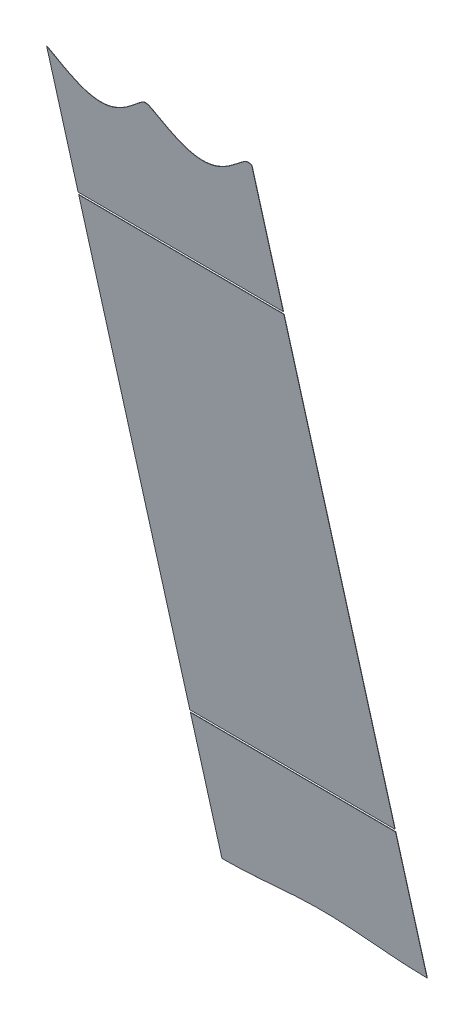
ISO-10303-21;
HEADER;
FILE_DESCRIPTION(('STEP AP214'),'2;1');
FILE_NAME('part.step','',(''),(''),'','','');
FILE_SCHEMA(('AUTOMOTIVE_DESIGN { 1 0 10303 214 1 1 1 1 }'));
ENDSEC;
DATA;
#1=APPLICATION_CONTEXT('core data for automotive mechanical design processes');
#2=APPLICATION_PROTOCOL_DEFINITION('international standard','automotive_design',2000,#1);
#3=PRODUCT_CONTEXT('',#1,'mechanical');
#4=PRODUCT('Part','Part','',(#3));
#5=PRODUCT_RELATED_PRODUCT_CATEGORY('part','',(#4));
#6=PRODUCT_DEFINITION_FORMATION('','',#4);
#7=PRODUCT_DEFINITION_CONTEXT('part definition',#1,'design');
#8=PRODUCT_DEFINITION('design','',#6,#7);
#9=PRODUCT_DEFINITION_SHAPE('','',#8);
#10=(LENGTH_UNIT() NAMED_UNIT(*) SI_UNIT(.MILLI.,.METRE.));
#11=(NAMED_UNIT(*) PLANE_ANGLE_UNIT() SI_UNIT($,.RADIAN.));
#12=(NAMED_UNIT(*) SI_UNIT($,.STERADIAN.) SOLID_ANGLE_UNIT());
#13=UNCERTAINTY_MEASURE_WITH_UNIT(LENGTH_MEASURE(1.E-05),#10,'distance_accuracy_value','');
#14=(GEOMETRIC_REPRESENTATION_CONTEXT(3) GLOBAL_UNCERTAINTY_ASSIGNED_CONTEXT((#13)) GLOBAL_UNIT_ASSIGNED_CONTEXT((#10,
#11,#12)) REPRESENTATION_CONTEXT('',''));
#15=CARTESIAN_POINT('',(0.,0.,0.));
#16=DIRECTION('',(0.,0.,1.));
#17=DIRECTION('',(1.,0.,0.));
#18=AXIS2_PLACEMENT_3D('',#15,#16,#17);
#19=CARTESIAN_POINT('',(-2042.50921980011,-2777.14365641032,-1017.93932816714));
#20=DIRECTION('',(0.00396825396827988,0.216307580433428,-0.976317204400025));
#21=DIRECTION('',(0.,0.976324891543631,0.216309283555555));
#22=AXIS2_PLACEMENT_3D('',#19,#20,#21);
#23=PLANE('',#22);
#24=DIRECTION('',(-0.999992126449225,0.000858370172845619,-0.00387430512519836));
#25=VECTOR('',#24,1.);
#26=CARTESIAN_POINT('',(1159.43166885493,323.596464984366,-317.941720044152));
#27=LINE('',#26,#25);
#28=CARTESIAN_POINT('',(1159.43166885493,323.596464984366,-317.941720044152));
#29=VERTEX_POINT('',#28);
#30=CARTESIAN_POINT('',(1080.0503968254,323.664604037055,-318.249269734728));
#31=VERTEX_POINT('',#30);
#32=EDGE_CURVE('E14',#29,#31,#27,.T.);
#33=ORIENTED_EDGE('',*,*,#32,.F.);
#34=DIRECTION('',(0.,0.976324891543631,0.216309283555555));
#35=VECTOR('',#34,1.);
#36=CARTESIAN_POINT('',(1159.43166885493,268.764554189019,-330.089982823123));
#37=LINE('',#36,#35);
#38=CARTESIAN_POINT('',(1159.43166885493,268.76455418902,-330.089982823123));
#39=VERTEX_POINT('',#38);
#40=EDGE_CURVE('E97',#39,#29,#37,.T.);
#41=ORIENTED_EDGE('',*,*,#40,.F.);
#42=CARTESIAN_POINT('',(1080.0503968254,268.832693241709,-330.397532513701));
#43=CARTESIAN_POINT('',(1081.28657677685,268.832154777076,-330.392627343542));
#44=CARTESIAN_POINT('',(1083.75887986082,268.88232858076,-330.37146239786));
#45=CARTESIAN_POINT('',(1086.23015212249,268.981709060538,-330.339399675887));
#46=CARTESIAN_POINT('',(1088.10494027586,269.091496299278,-330.307455705871));
#47=CARTESIAN_POINT('',(1089.34359677935,269.174386300955,-330.284056508164));
#48=CARTESIAN_POINT('',(1090.5819230257,269.266799692385,-330.25854870186));
#49=CARTESIAN_POINT('',(1091.81975763451,269.367820493785,-330.231135882438));
#50=CARTESIAN_POINT('',(1093.05682318214,269.476437232262,-330.202043273976));
#51=CARTESIAN_POINT('',(1094.29259657661,269.591538717598,-330.171519191906));
#52=CARTESIAN_POINT('',(1095.52595576158,269.711886947185,-330.139842482029));
#53=CARTESIAN_POINT('',(1096.75397113525,269.836000428043,-330.107353283354));
#54=CARTESIAN_POINT('',(1097.41505008186,269.904474955457,-330.089495471958));
#55=CARTESIAN_POINT('',(1097.96579856127,269.961521458065,-330.074618031793));
#56=CARTESIAN_POINT('',(1098.93006794415,270.062854892485,-330.0482478565));
#57=CARTESIAN_POINT('',(1099.27554864505,270.09928975265,-330.038771334355));
#58=CARTESIAN_POINT('',(1099.47315232273,270.120129302719,-330.033351073187));
#59=CARTESIAN_POINT('',(1100.30136490481,270.207571078724,-330.010611663534));
#60=CARTESIAN_POINT('',(1100.51588102051,270.230189805864,-330.004728476654));
#61=CARTESIAN_POINT('',(1100.85940209737,270.266410905052,-329.995307279157));
#62=CARTESIAN_POINT('',(1101.8236620147,270.367703554007,-329.968946178545));
#63=CARTESIAN_POINT('',(1102.3763795837,270.424908617498,-329.954025605095));
#64=CARTESIAN_POINT('',(1103.03667741919,270.49324800405,-329.936200909616));
#65=CARTESIAN_POINT('',(1104.26501988036,270.617244420893,-329.903736317562));
#66=CARTESIAN_POINT('',(1105.49851344342,270.737407020949,-329.872100188583));
#67=CARTESIAN_POINT('',(1106.7343548516,270.852269552151,-329.841628771461));
#68=CARTESIAN_POINT('',(1107.97145931655,270.96060030897,-329.812599365374));
#69=CARTESIAN_POINT('',(1109.20931799006,271.061292397321,-329.785259276033));
#70=CARTESIAN_POINT('',(1110.44766017679,271.153338232103,-329.75983283881));
#71=CARTESIAN_POINT('',(1111.68632768145,271.235825718451,-329.736522775517));
#72=CARTESIAN_POINT('',(1113.56097135429,271.344947989544,-329.704726719393));
#73=CARTESIAN_POINT('',(1116.03227482633,271.443367873024,-329.672876695106));
#74=CARTESIAN_POINT('',(1118.50464108415,271.492521149077,-329.651937595258));
#75=CARTESIAN_POINT('',(1120.97732547755,271.490399688146,-329.642357356854));
#76=CARTESIAN_POINT('',(1123.44969181017,271.43700399542,-329.644138453798));
#77=CARTESIAN_POINT('',(1125.92099538589,271.334343396408,-329.65683873758));
#78=CARTESIAN_POINT('',(1127.79563873341,271.22200414699,-329.674108504261));
#79=CARTESIAN_POINT('',(1129.03430617277,271.137390979305,-329.687820361977));
#80=CARTESIAN_POINT('',(1130.27264842064,271.043219945334,-329.703651130805));
#81=CARTESIAN_POINT('',(1131.51050729436,270.940403398927,-329.721399317477));
#82=CARTESIAN_POINT('',(1132.74761175264,270.82994941386,-329.740842680246));
#83=CARTESIAN_POINT('',(1133.98345321428,270.712965731145,-329.761737861118));
#84=CARTESIAN_POINT('',(1135.21694709448,270.590685890966,-329.783815971882));
#85=CARTESIAN_POINT('',(1136.44529010488,270.464580955938,-329.806762485833));
#86=CARTESIAN_POINT('',(1137.10568609662,270.395097781947,-329.819472615467));
#87=CARTESIAN_POINT('',(1137.65830764849,270.336954031955,-329.830108494017));
#88=CARTESIAN_POINT('',(1138.62256752162,270.23400607159,-329.848997842751));
#89=CARTESIAN_POINT('',(1138.96618465982,270.197184952217,-329.855759095281));
#90=CARTESIAN_POINT('',(1139.18062966248,270.174205583134,-329.859978666005));
#91=CARTESIAN_POINT('',(1140.00885358341,270.085340754786,-329.876300751771));
#92=CARTESIAN_POINT('',(1140.20651703528,270.064155553607,-329.880191025151));
#93=CARTESIAN_POINT('',(1140.55190227623,270.027137805791,-329.886988655143));
#94=CARTESIAN_POINT('',(1141.51617143731,269.924148904419,-329.905887036795));
#95=CARTESIAN_POINT('',(1142.06701559847,269.866146738319,-329.916498771008));
#96=CARTESIAN_POINT('',(1142.72799642586,269.796547525979,-329.929232232401));
#97=CARTESIAN_POINT('',(1143.95601107499,269.670325623311,-329.952205995701));
#98=CARTESIAN_POINT('',(1145.18937001639,269.547859650603,-329.974325893447));
#99=CARTESIAN_POINT('',(1146.42514337524,269.430636164723,-329.99527448062));
#100=CARTESIAN_POINT('',(1147.66220883727,269.31989512445,-330.014781600296));
#101=CARTESIAN_POINT('',(1148.90004339047,269.216748615348,-330.032602990575));
#102=CARTESIAN_POINT('',(1150.13836962374,269.122208593316,-330.048515575502));
#103=CARTESIAN_POINT('',(1151.37702611206,269.037191325289,-330.062317008024));
#104=CARTESIAN_POINT('',(1153.25181459674,268.924184215867,-330.079734152258));
#105=CARTESIAN_POINT('',(1155.72308681032,268.820559266117,-330.092648219866));
#106=CARTESIAN_POINT('',(1158.19543971364,268.766138004114,-330.094656590998));
#107=CARTESIAN_POINT('',(1159.43166885493,268.76455418902,-330.089982823124));
#108=B_SPLINE_CURVE_WITH_KNOTS('',2,(#42,#43,#44,#45,#46,#47,#48,#49,#50,#51,#52,#53,#54,#55,
#56,#57,#58,#59,#60,#61,#62,#63,#64,#65,#66,#67,#68,#69,#70,#71,#72,#73,#74,#75,#76,#77,#78,#79,
#80,#81,#82,#83,#84,#85,#86,#87,#88,#89,#90,#91,#92,#93,#94,#95,#96,#97,#98,#99,#100,#101,#102,
#103,#104,#105,#106,#107),.UNSPECIFIED.,.F.,.F.,(3,1,1,1,1,1,1,1,1,1,1,2,1,2,1,2,1,2,1,1,1,1,1,
1,1,1,1,1,1,1,1,1,1,1,1,1,1,1,1,2,1,2,1,2,1,2,1,1,1,1,1,1,1,1,1,1,3),(0.,0.03125,0.0625,0.09375,
0.109375,0.125,0.140625,0.15625,0.171875,0.1875,0.203125,0.21875,0.234375,0.2421875,0.25,
0.2578125,0.265625,0.28125,0.296875,0.3125,0.328125,0.34375,0.359375,0.375,0.390625,0.40625,
0.4375,0.46875,0.5,0.53125,0.5625,0.59375,0.609375,0.625,0.640625,0.65625,0.671875,0.6875,
0.703125,0.71875,0.734375,0.7421875,0.75,0.7578125,0.765625,0.78125,0.796875,0.8125,0.828125,
0.84375,0.859375,0.875,0.890625,0.90625,0.9375,0.96875,1.),.UNSPECIFIED.);
#109=CARTESIAN_POINT('',(1080.0503968254,268.832693241709,-330.397532513701));
#110=VERTEX_POINT('',#109);
#111=EDGE_CURVE('E114',#110,#39,#108,.T.);
#112=ORIENTED_EDGE('',*,*,#111,.F.);
#113=DIRECTION('',(0.,0.976324891543631,0.216309283555555));
#114=VECTOR('',#113,1.);
#115=CARTESIAN_POINT('',(1080.0503968254,268.832693241708,-330.3975325137));
#116=LINE('',#115,#114);
#117=EDGE_CURVE('E100',#110,#31,#116,.T.);
#118=ORIENTED_EDGE('',*,*,#117,.T.);
#119=EDGE_LOOP('',(#33,#41,#112,#118));
#120=FACE_BOUND('',#119,.T.);
#121=ADVANCED_FACE('F50',(#120),#23,.T.);
#122=CARTESIAN_POINT('',(-2042.50961662551,-2777.16528716836,-1017.8416964467));
#123=DIRECTION('',(0.00396825396827988,0.216307580433428,-0.976317204400025));
#124=DIRECTION('',(0.,0.976324891543631,0.216309283555555));
#125=AXIS2_PLACEMENT_3D('',#122,#123,#124);
#126=PLANE('',#125);
#127=DIRECTION('',(0.,0.976324891543631,0.216309283555555));
#128=VECTOR('',#127,1.);
#129=CARTESIAN_POINT('',(1159.43127202953,268.742923430976,-329.992351102683));
#130=LINE('',#129,#128);
#131=CARTESIAN_POINT('',(1159.43127202953,268.742923430977,-329.992351102683));
#132=VERTEX_POINT('',#131);
#133=CARTESIAN_POINT('',(1159.43127202953,323.574834226331,-317.844088323747));
#134=VERTEX_POINT('',#133);
#135=EDGE_CURVE('E109',#132,#134,#130,.T.);
#136=ORIENTED_EDGE('',*,*,#135,.T.);
#137=DIRECTION('',(-0.999992126449225,0.000858370172845612,-0.00387430512519833));
#138=VECTOR('',#137,1.);
#139=CARTESIAN_POINT('',(-2042.50961662551,326.323306420595,-330.249481993707));
#140=LINE('',#139,#138);
#141=CARTESIAN_POINT('',(1080.05,323.64297327902,-318.151638014323));
#142=VERTEX_POINT('',#141);
#143=EDGE_CURVE('E67',#134,#142,#140,.T.);
#144=ORIENTED_EDGE('',*,*,#143,.T.);
#145=DIRECTION('',(0.,0.976324891543631,0.216309283555555));
#146=VECTOR('',#145,1.);
#147=CARTESIAN_POINT('',(1080.05,268.811062483665,-330.29990079326));
#148=LINE('',#147,#146);
#149=CARTESIAN_POINT('',(1080.05,268.811062483666,-330.299900793261));
#150=VERTEX_POINT('',#149);
#151=EDGE_CURVE('E53',#150,#142,#148,.T.);
#152=ORIENTED_EDGE('',*,*,#151,.F.);
#153=CARTESIAN_POINT('',(1080.05,268.811062483666,-330.299900793261));
#154=CARTESIAN_POINT('',(1081.28617995146,268.810524019033,-330.294995623102));
#155=CARTESIAN_POINT('',(1083.75848303542,268.860697822717,-330.27383067742));
#156=CARTESIAN_POINT('',(1086.22975529709,268.960078302495,-330.241767955447));
#157=CARTESIAN_POINT('',(1088.10454345046,269.069865541234,-330.209823985431));
#158=CARTESIAN_POINT('',(1089.34319995395,269.152755542912,-330.186424787724));
#159=CARTESIAN_POINT('',(1090.58152620031,269.245168934341,-330.16091698142));
#160=CARTESIAN_POINT('',(1091.81936080911,269.346189735742,-330.133504161998));
#161=CARTESIAN_POINT('',(1093.05642635674,269.454806474218,-330.104411553536));
#162=CARTESIAN_POINT('',(1094.29219975121,269.569907959554,-330.073887471465));
#163=CARTESIAN_POINT('',(1095.52555893618,269.690256189142,-330.042210761589));
#164=CARTESIAN_POINT('',(1096.75357430985,269.81436967,-330.009721562914));
#165=CARTESIAN_POINT('',(1097.41465325646,269.882844197413,-329.991863751517));
#166=CARTESIAN_POINT('',(1097.96540173588,269.939890700022,-329.976986311353));
#167=CARTESIAN_POINT('',(1098.92967111876,270.041224134441,-329.95061613606));
#168=CARTESIAN_POINT('',(1099.27515181965,270.077658994607,-329.941139613915));
#169=CARTESIAN_POINT('',(1099.47275549733,270.098498544676,-329.935719352747));
#170=CARTESIAN_POINT('',(1100.30096807942,270.185940320681,-329.912979943094));
#171=CARTESIAN_POINT('',(1100.51548419511,270.20855904782,-329.907096756214));
#172=CARTESIAN_POINT('',(1100.85900527198,270.244780147008,-329.897675558717));
#173=CARTESIAN_POINT('',(1101.82326518931,270.346072795963,-329.871314458105));
#174=CARTESIAN_POINT('',(1102.37598275831,270.403277859455,-329.856393884655));
#175=CARTESIAN_POINT('',(1103.03628059379,270.471617246007,-329.838569189176));
#176=CARTESIAN_POINT('',(1104.26462305496,270.59561366285,-329.806104597122));
#177=CARTESIAN_POINT('',(1105.49811661802,270.715776262905,-329.774468468143));
#178=CARTESIAN_POINT('',(1106.7339580262,270.830638794108,-329.743997051021));
#179=CARTESIAN_POINT('',(1107.97106249115,270.938969550926,-329.714967644934));
#180=CARTESIAN_POINT('',(1109.20892116466,271.039661639278,-329.687627555593));
#181=CARTESIAN_POINT('',(1110.44726335139,271.131707474059,-329.66220111837));
#182=CARTESIAN_POINT('',(1111.68593085606,271.214194960407,-329.638891055077));
#183=CARTESIAN_POINT('',(1113.56057452889,271.323317231501,-329.607094998953));
#184=CARTESIAN_POINT('',(1116.03187800094,271.42173711498,-329.575244974666));
#185=CARTESIAN_POINT('',(1118.50424425875,271.470890391033,-329.554305874818));
#186=CARTESIAN_POINT('',(1120.97692865215,271.468768930103,-329.544725636414));
#187=CARTESIAN_POINT('',(1123.44929498477,271.415373237377,-329.546506733358));
#188=CARTESIAN_POINT('',(1125.92059856049,271.312712638365,-329.55920701714));
#189=CARTESIAN_POINT('',(1127.79524190801,271.200373388946,-329.576476783821));
#190=CARTESIAN_POINT('',(1129.03390934738,271.115760221261,-329.590188641537));
#191=CARTESIAN_POINT('',(1130.27225159524,271.021589187291,-329.606019410365));
#192=CARTESIAN_POINT('',(1131.51011046896,270.918772640883,-329.623767597037));
#193=CARTESIAN_POINT('',(1132.74721492724,270.808318655817,-329.643210959806));
#194=CARTESIAN_POINT('',(1133.98305638889,270.691334973101,-329.664106140678));
#195=CARTESIAN_POINT('',(1135.21655026909,270.569055132923,-329.686184251442));
#196=CARTESIAN_POINT('',(1136.44489327949,270.442950197895,-329.709130765393));
#197=CARTESIAN_POINT('',(1137.10528927123,270.373467023903,-329.721840895027));
#198=CARTESIAN_POINT('',(1137.65791082309,270.315323273911,-329.732476773577));
#199=CARTESIAN_POINT('',(1138.62217069622,270.212375313547,-329.751366122311));
#200=CARTESIAN_POINT('',(1138.96578783442,270.175554194174,-329.758127374841));
#201=CARTESIAN_POINT('',(1139.18023283708,270.152574825091,-329.762346945565));
#202=CARTESIAN_POINT('',(1140.00845675801,270.063709996743,-329.778669031331));
#203=CARTESIAN_POINT('',(1140.20612020988,270.042524795564,-329.782559304711));
#204=CARTESIAN_POINT('',(1140.55150545083,270.005507047748,-329.789356934703));
#205=CARTESIAN_POINT('',(1141.51577461191,269.902518146376,-329.808255316355));
#206=CARTESIAN_POINT('',(1142.06661877307,269.844515980276,-329.818867050568));
#207=CARTESIAN_POINT('',(1142.72759960047,269.774916767936,-329.831600511961));
#208=CARTESIAN_POINT('',(1143.9556142496,269.648694865268,-329.854574275261));
#209=CARTESIAN_POINT('',(1145.18897319099,269.52622889256,-329.876694173007));
#210=CARTESIAN_POINT('',(1146.42474654984,269.40900540668,-329.89764276018));
#211=CARTESIAN_POINT('',(1147.66181201187,269.298264366406,-329.917149879856));
#212=CARTESIAN_POINT('',(1148.89964656507,269.195117857305,-329.934971270135));
#213=CARTESIAN_POINT('',(1150.13797279835,269.100577835273,-329.950883855062));
#214=CARTESIAN_POINT('',(1151.37662928667,269.015560567245,-329.964685287584));
#215=CARTESIAN_POINT('',(1153.25141777134,268.902553457823,-329.982102431818));
#216=CARTESIAN_POINT('',(1155.72268998492,268.798928508073,-329.995016499426));
#217=CARTESIAN_POINT('',(1158.19504288824,268.744507246071,-329.997024870558));
#218=CARTESIAN_POINT('',(1159.43127202953,268.742923430977,-329.992351102684));
#219=B_SPLINE_CURVE_WITH_KNOTS('',2,(#153,#154,#155,#156,#157,#158,#159,#160,#161,#162,#163,
#164,#165,#166,#167,#168,#169,#170,#171,#172,#173,#174,#175,#176,#177,#178,#179,#180,#181,#182,
#183,#184,#185,#186,#187,#188,#189,#190,#191,#192,#193,#194,#195,#196,#197,#198,#199,#200,#201,
#202,#203,#204,#205,#206,#207,#208,#209,#210,#211,#212,#213,#214,#215,#216,#217,#218),
.UNSPECIFIED.,.F.,.F.,(3,1,1,1,1,1,1,1,1,1,1,2,1,2,1,2,1,2,1,1,1,1,1,1,1,1,1,1,1,1,1,1,1,1,1,1,
1,1,1,2,1,2,1,2,1,2,1,1,1,1,1,1,1,1,1,1,3),(0.,0.03125,0.0625,0.09375,0.109375,0.125,0.140625,
0.15625,0.171875,0.1875,0.203125,0.21875,0.234375,0.2421875,0.25,0.2578125,0.265625,0.28125,
0.296875,0.3125,0.328125,0.34375,0.359375,0.375,0.390625,0.40625,0.4375,0.46875,0.5,0.53125,
0.5625,0.59375,0.609375,0.625,0.640625,0.65625,0.671875,0.6875,0.703125,0.71875,0.734375,
0.7421875,0.75,0.7578125,0.765625,0.78125,0.796875,0.8125,0.828125,0.84375,0.859375,0.875,
0.890625,0.90625,0.9375,0.96875,1.),.UNSPECIFIED.);
#220=EDGE_CURVE('E102',#150,#132,#219,.T.);
#221=ORIENTED_EDGE('',*,*,#220,.T.);
#222=EDGE_LOOP('',(#136,#144,#152,#221));
#223=FACE_BOUND('',#222,.T.);
#224=ADVANCED_FACE('F135',(#223),#126,.F.);
#225=CARTESIAN_POINT('',(1159.43166885493,268.764554189019,-330.089982823123));
#226=DIRECTION('',(0.999992126449225,-0.000858370172842011,0.00387430512518117));
#227=DIRECTION('',(0.00387430655247471,0.,-0.999992494846205));
#228=AXIS2_PLACEMENT_3D('',#225,#226,#227);
#229=PLANE('',#228);
#230=DIRECTION('',(0.00396825396827988,0.216307580433428,-0.976317204400025));
#231=VECTOR('',#230,1.);
#232=CARTESIAN_POINT('',(1159.39198631525,321.433389180032,-308.178548000151));
#233=LINE('',#232,#231);
#234=EDGE_CURVE('E59',#134,#29,#233,.T.);
#235=ORIENTED_EDGE('',*,*,#234,.F.);
#236=ORIENTED_EDGE('',*,*,#135,.F.);
#237=DIRECTION('',(-0.00396825396826235,-0.216307580433426,0.976317204400025));
#238=VECTOR('',#237,1.);
#239=CARTESIAN_POINT('',(1159.43166885493,268.76455418902,-330.089982823123));
#240=LINE('',#239,#238);
#241=EDGE_CURVE('E91',#39,#132,#240,.T.);
#242=ORIENTED_EDGE('',*,*,#241,.F.);
#243=ORIENTED_EDGE('',*,*,#40,.T.);
#244=EDGE_LOOP('',(#235,#236,#242,#243));
#245=FACE_BOUND('',#244,.T.);
#246=ADVANCED_FACE('F101',(#245),#229,.T.);
#247=CARTESIAN_POINT('',(1080.0503968254,268.832693241708,-330.3975325137));
#248=DIRECTION('',(0.999992126449225,-0.000858370172841317,0.00387430512518132));
#249=DIRECTION('',(0.00387430655247487,0.,-0.999992494846205));
#250=AXIS2_PLACEMENT_3D('',#247,#248,#249);
#251=PLANE('',#250);
#252=ORIENTED_EDGE('',*,*,#151,.T.);
#253=DIRECTION('',(0.00396825396826235,0.216307580433428,-0.976317204400025));
#254=VECTOR('',#253,1.);
#255=CARTESIAN_POINT('',(1080.0503968254,323.664604037055,-318.249269734728));
#256=LINE('',#255,#254);
#257=EDGE_CURVE('E105',#142,#31,#256,.T.);
#258=ORIENTED_EDGE('',*,*,#257,.T.);
#259=ORIENTED_EDGE('',*,*,#117,.F.);
#260=DIRECTION('',(-0.00396825396826235,-0.216307580433426,0.976317204400025));
#261=VECTOR('',#260,1.);
#262=CARTESIAN_POINT('',(1080.0503968254,268.832693241709,-330.397532513701));
#263=LINE('',#262,#261);
#264=EDGE_CURVE('E118',#110,#150,#263,.T.);
#265=ORIENTED_EDGE('',*,*,#264,.T.);
#266=EDGE_LOOP('',(#252,#258,#259,#265));
#267=FACE_BOUND('',#266,.T.);
#268=ADVANCED_FACE('F129',(#267),#251,.F.);
#269=DIRECTION('',(-0.00396825396826235,-0.216307580433426,0.976317204400025));
#270=VECTOR('',#269,1.);
#271=SURFACE_OF_LINEAR_EXTRUSION('',#108,#270);
#272=ORIENTED_EDGE('',*,*,#220,.F.);
#273=ORIENTED_EDGE('',*,*,#264,.F.);
#274=ORIENTED_EDGE('',*,*,#111,.T.);
#275=ORIENTED_EDGE('',*,*,#241,.T.);
#276=EDGE_LOOP('',(#272,#273,#274,#275));
#277=FACE_BOUND('',#276,.T.);
#278=ADVANCED_FACE('F126',(#277),#271,.T.);
#279=CARTESIAN_POINT('',(1159.39198631525,321.433389180032,-308.178548000151));
#280=DIRECTION('',(0.,-0.976324891543631,-0.216309283555555));
#281=DIRECTION('',(0.,0.216309283555555,-0.976324891543631));
#282=AXIS2_PLACEMENT_3D('',#279,#280,#281);
#283=PLANE('',#282);
#284=ORIENTED_EDGE('',*,*,#234,.T.);
#285=ORIENTED_EDGE('',*,*,#32,.T.);
#286=ORIENTED_EDGE('',*,*,#257,.F.);
#287=ORIENTED_EDGE('',*,*,#143,.F.);
#288=EDGE_LOOP('',(#284,#285,#286,#287));
#289=FACE_BOUND('',#288,.T.);
#290=ADVANCED_FACE('F86',(#289),#283,.F.);
#291=CLOSED_SHELL('',(#121,#224,#246,#268,#278,#290));
#292=MANIFOLD_SOLID_BREP('B2',#291);
#293=CARTESIAN_POINT('',(1080.0503968254,268.832693241708,-330.3975325137));
#294=DIRECTION('',(0.999992126449225,-0.000858370172841317,0.00387430512518132));
#295=DIRECTION('',(0.00387430655247487,0.,-0.999992494846205));
#296=AXIS2_PLACEMENT_3D('',#293,#294,#295);
#297=PLANE('',#296);
#298=DIRECTION('',(0.,0.976324891543631,0.216309283555555));
#299=VECTOR('',#298,1.);
#300=CARTESIAN_POINT('',(1080.0503968254,268.832693241708,-330.3975325137));
#301=LINE('',#300,#299);
#302=CARTESIAN_POINT('',(1080.0503968254,518.929582345781,-274.987413023618));
#303=VERTEX_POINT('',#302);
#304=CARTESIAN_POINT('',(1080.0503968254,573.69836152107,-262.853137346298));
#305=VERTEX_POINT('',#304);
#306=EDGE_CURVE('E250',#303,#305,#301,.T.);
#307=ORIENTED_EDGE('',*,*,#306,.F.);
#308=DIRECTION('',(0.00396825396827988,0.216307580433428,-0.976317204400025));
#309=VECTOR('',#308,1.);
#310=CARTESIAN_POINT('',(1080.01071428571,516.766506541447,-265.224240979617));
#311=LINE('',#310,#309);
#312=CARTESIAN_POINT('',(1080.05,518.907951587738,-274.889781303177));
#313=VERTEX_POINT('',#312);
#314=EDGE_CURVE('E203',#313,#303,#311,.T.);
#315=ORIENTED_EDGE('',*,*,#314,.F.);
#316=DIRECTION('',(0.,0.976324891543631,0.216309283555555));
#317=VECTOR('',#316,1.);
#318=CARTESIAN_POINT('',(1080.05,268.811062483665,-330.29990079326));
#319=LINE('',#318,#317);
#320=CARTESIAN_POINT('',(1080.05,573.676730763027,-262.755505625858));
#321=VERTEX_POINT('',#320);
#322=EDGE_CURVE('E197',#313,#321,#319,.T.);
#323=ORIENTED_EDGE('',*,*,#322,.T.);
#324=DIRECTION('',(-0.00396825396826235,-0.216307580433426,0.976317204400025));
#325=VECTOR('',#324,1.);
#326=CARTESIAN_POINT('',(1080.0503968254,573.69836152107,-262.853137346298));
#327=LINE('',#326,#325);
#328=EDGE_CURVE('E261',#305,#321,#327,.T.);
#329=ORIENTED_EDGE('',*,*,#328,.F.);
#330=EDGE_LOOP('',(#307,#315,#323,#329));
#331=FACE_BOUND('',#330,.T.);
#332=ADVANCED_FACE('F194',(#331),#297,.F.);
#333=CARTESIAN_POINT('',(1159.43166885493,268.764554189019,-330.089982823123));
#334=DIRECTION('',(0.999992126449225,-0.000858370172842011,0.00387430512518117));
#335=DIRECTION('',(0.00387430655247471,0.,-0.999992494846205));
#336=AXIS2_PLACEMENT_3D('',#333,#334,#335);
#337=PLANE('',#336);
#338=DIRECTION('',(0.00396825396827988,0.216307580433428,-0.976317204400025));
#339=VECTOR('',#338,1.);
#340=CARTESIAN_POINT('',(1159.39198631525,516.698367488758,-264.916691289041));
#341=LINE('',#340,#339);
#342=CARTESIAN_POINT('',(1159.43127202953,518.839812535049,-274.5822316126));
#343=VERTEX_POINT('',#342);
#344=CARTESIAN_POINT('',(1159.43166885493,518.861443293092,-274.679863333041));
#345=VERTEX_POINT('',#344);
#346=EDGE_CURVE('E243',#343,#345,#341,.T.);
#347=ORIENTED_EDGE('',*,*,#346,.T.);
#348=DIRECTION('',(0.,0.976324891543631,0.216309283555555));
#349=VECTOR('',#348,1.);
#350=CARTESIAN_POINT('',(1159.43166885493,268.764554189019,-330.089982823123));
#351=LINE('',#350,#349);
#352=CARTESIAN_POINT('',(1159.43166885493,573.693354088438,-262.531600554068));
#353=VERTEX_POINT('',#352);
#354=EDGE_CURVE('E237',#345,#353,#351,.T.);
#355=ORIENTED_EDGE('',*,*,#354,.T.);
#356=DIRECTION('',(-0.00396825396826235,-0.216307580433426,0.976317204400025));
#357=VECTOR('',#356,1.);
#358=CARTESIAN_POINT('',(1159.43166885493,573.693354088438,-262.531600554068));
#359=LINE('',#358,#357);
#360=CARTESIAN_POINT('',(1159.43127202953,573.671723330395,-262.433968833628));
#361=VERTEX_POINT('',#360);
#362=EDGE_CURVE('E241',#353,#361,#359,.T.);
#363=ORIENTED_EDGE('',*,*,#362,.T.);
#364=DIRECTION('',(0.,0.976324891543631,0.216309283555555));
#365=VECTOR('',#364,1.);
#366=CARTESIAN_POINT('',(1159.43127202953,268.742923430976,-329.992351102683));
#367=LINE('',#366,#365);
#368=EDGE_CURVE('E227',#343,#361,#367,.T.);
#369=ORIENTED_EDGE('',*,*,#368,.F.);
#370=EDGE_LOOP('',(#347,#355,#363,#369));
#371=FACE_BOUND('',#370,.T.);
#372=ADVANCED_FACE('F239',(#371),#337,.T.);
#373=CARTESIAN_POINT('',(-2042.50921980011,-2777.14365641032,-1017.93932816714));
#374=DIRECTION('',(0.00396825396827988,0.216307580433428,-0.976317204400025));
#375=DIRECTION('',(0.,0.976324891543631,0.216309283555555));
#376=AXIS2_PLACEMENT_3D('',#373,#374,#375);
#377=PLANE('',#376);
#378=DIRECTION('',(0.999992126449225,-0.000858370172845619,0.00387430512519906));
#379=VECTOR('',#378,1.);
#380=CARTESIAN_POINT('',(1159.43166885493,518.861443293092,-274.679863333041));
#381=LINE('',#380,#379);
#382=EDGE_CURVE('E48',#303,#345,#381,.T.);
#383=ORIENTED_EDGE('',*,*,#382,.F.);
#384=ORIENTED_EDGE('',*,*,#306,.T.);
#385=CARTESIAN_POINT('',(1080.0503968254,573.69836152107,-262.853137346299));
#386=CARTESIAN_POINT('',(1080.31788439468,573.526529227821,-262.890120376836));
#387=CARTESIAN_POINT('',(1080.89841880987,573.089672839256,-262.984548335286));
#388=CARTESIAN_POINT('',(1081.20861964545,572.838191218939,-263.039004433035));
#389=CARTESIAN_POINT('',(1081.63466085939,572.492797130604,-263.113796436574));
#390=CARTESIAN_POINT('',(1082.30415892398,571.918970708603,-263.238209143871));
#391=CARTESIAN_POINT('',(1082.50791152955,571.744334462725,-263.276072454636));
#392=CARTESIAN_POINT('',(1082.84543916793,571.453208471276,-263.339200875547));
#393=CARTESIAN_POINT('',(1083.30010014881,571.061052055682,-263.424236962991));
#394=CARTESIAN_POINT('',(1083.3865788515,570.98658479811,-263.440384033616));
#395=CARTESIAN_POINT('',(1084.01692328186,570.443791953263,-263.558080249191));
#396=CARTESIAN_POINT('',(1084.47679131646,570.055660052889,-263.642203522586));
#397=CARTESIAN_POINT('',(1085.06525309835,569.558994112837,-263.749850342186));
#398=CARTESIAN_POINT('',(1086.16685875163,568.66339332208,-263.943797338331));
#399=CARTESIAN_POINT('',(1086.70735084761,568.246451537767,-264.033975876868));
#400=CARTESIAN_POINT('',(1087.92003276377,567.310974838509,-264.236306093577));
#401=CARTESIAN_POINT('',(1089.02873711263,566.578595024407,-264.394061876657));
#402=CARTESIAN_POINT('',(1090.31018999781,565.732102244974,-264.576397774943));
#403=CARTESIAN_POINT('',(1091.52017718698,565.111326348714,-264.70901552977));
#404=CARTESIAN_POINT('',(1092.87975959652,564.413801617559,-264.858029311296));
#405=CARTESIAN_POINT('',(1094.18995461416,563.97986765943,-264.948844076798));
#406=CARTESIAN_POINT('',(1095.62004838482,563.506223475132,-265.047969496052));
#407=CARTESIAN_POINT('',(1098.47390204364,563.159898783333,-265.11309980384));
#408=CARTESIAN_POINT('',(1101.335114304,563.44659986613,-265.037950421955));
#409=CARTESIAN_POINT('',(1102.7710244245,563.895846000591,-264.932581593121));
#410=CARTESIAN_POINT('',(1104.0881967644,564.307943229848,-264.835925886858));
#411=CARTESIAN_POINT('',(1105.45170411015,564.987377405786,-264.679852117585));
#412=CARTESIAN_POINT('',(1106.66923269785,565.594070530868,-264.540487796247));
#413=CARTESIAN_POINT('',(1107.95561454236,566.430164423179,-264.350018821736));
#414=CARTESIAN_POINT('',(1109.07287644609,567.156337493649,-264.184590702571));
#415=CARTESIAN_POINT('',(1110.29163149233,568.088560498384,-263.973098749754));
#416=CARTESIAN_POINT('',(1110.8377694839,568.506300224725,-263.878326801363));
#417=CARTESIAN_POINT('',(1111.9440279512,569.400668631236,-263.675678953216));
#418=CARTESIAN_POINT('',(1112.5290891753,569.892605616175,-263.564310055923));
#419=CARTESIAN_POINT('',(1112.99273545153,570.28245327965,-263.476053011377));
#420=CARTESIAN_POINT('',(1113.61409444164,570.816337538286,-263.35524296935));
#421=CARTESIAN_POINT('',(1113.75698058643,570.939108214655,-263.327461797061));
#422=CARTESIAN_POINT('',(1114.49899781496,571.57819348856,-263.182853567825));
#423=CARTESIAN_POINT('',(1114.69339166376,571.744685582192,-263.145176360119));
#424=CARTESIAN_POINT('',(1115.36597755549,572.320733815984,-263.014816482485));
#425=CARTESIAN_POINT('',(1115.78800086419,572.662992351324,-262.937272205901));
#426=CARTESIAN_POINT('',(1116.09898821874,572.91520135088,-262.880130126452));
#427=CARTESIAN_POINT('',(1116.67969149545,573.352323698425,-262.78092337787));
#428=CARTESIAN_POINT('',(1117.29557156047,573.7476178393,-262.690840884918));
#429=CARTESIAN_POINT('',(1117.76287921363,573.947447141604,-262.644668403139));
#430=CARTESIAN_POINT('',(1118.11241709463,574.038646676946,-262.623042024116));
#431=CARTESIAN_POINT('',(1118.46956857436,574.05849396198,-262.617193119728));
#432=CARTESIAN_POINT('',(1118.82385194065,574.003202222236,-262.628003270384));
#433=CARTESIAN_POINT('',(1119.30437922003,573.838981897031,-262.662433931616));
#434=CARTESIAN_POINT('',(1119.93270320835,573.470606266688,-262.741495420836));
#435=CARTESIAN_POINT('',(1120.52255560918,573.050190184284,-262.832243080541));
#436=CARTESIAN_POINT('',(1121.01209217389,572.668892685965,-262.914731572507));
#437=CARTESIAN_POINT('',(1121.52208493209,572.258496534401,-263.003583860868));
#438=CARTESIAN_POINT('',(1122.21068015388,571.685963796097,-263.127632325931));
#439=CARTESIAN_POINT('',(1122.77652196183,571.211228572843,-263.230512233236));
#440=CARTESIAN_POINT('',(1123.6892749593,570.44721514056,-263.396073037166));
#441=CARTESIAN_POINT('',(1124.14653032662,570.072104062357,-263.477322106563));
#442=CARTESIAN_POINT('',(1124.73354025433,569.590548365827,-263.581627083088));
#443=CARTESIAN_POINT('',(1125.8359853196,568.719916881501,-263.770038602407));
#444=CARTESIAN_POINT('',(1126.37895293559,568.313655353851,-263.857840819029));
#445=CARTESIAN_POINT('',(1127.6114044719,567.391505249219,-264.057138113344));
#446=CARTESIAN_POINT('',(1128.73817452589,566.674629500917,-264.211385470831));
#447=CARTESIAN_POINT('',(1130.02294732066,565.857228953755,-264.387262357038));
#448=CARTESIAN_POINT('',(1131.23811233358,565.262441152483,-264.514101284205));
#449=CARTESIAN_POINT('',(1132.60038646737,564.595647730889,-264.656295461784));
#450=CARTESIAN_POINT('',(1133.91564609479,564.18839322224,-264.741178687008));
#451=CARTESIAN_POINT('',(1135.34288445289,563.746465830765,-264.833288710363));
#452=CARTESIAN_POINT('',(1138.19248405488,563.449676372378,-264.887461549349));
#453=CARTESIAN_POINT('',(1141.04300656443,563.766682788418,-264.805641329715));
#454=CARTESIAN_POINT('',(1142.47222022203,564.218163871669,-264.699804555527));
#455=CARTESIAN_POINT('',(1143.78699742516,564.633495080367,-264.602442081265));
#456=CARTESIAN_POINT('',(1145.15075718716,565.307444831147,-264.447582385737));
#457=CARTESIAN_POINT('',(1146.36093449581,565.905496422265,-264.310162515482));
#458=CARTESIAN_POINT('',(1147.64189345605,566.723440342836,-264.123736792319));
#459=CARTESIAN_POINT('',(1148.76686318018,567.441778849567,-263.960013128356));
#460=CARTESIAN_POINT('',(1149.99861383009,568.363898940389,-263.750706701921));
#461=CARTESIAN_POINT('',(1150.5417395519,568.770496769226,-263.658415535731));
#462=CARTESIAN_POINT('',(1151.64570701697,569.641967012184,-263.460850193157));
#463=CARTESIAN_POINT('',(1152.23374706215,570.123886963902,-263.351688508326));
#464=CARTESIAN_POINT('',(1152.69465208085,570.501615192078,-263.266127722455));
#465=CARTESIAN_POINT('',(1153.33318229518,571.035500899649,-263.145247566746));
#466=CARTESIAN_POINT('',(1153.363832372,571.061127937472,-263.139445200662));
#467=CARTESIAN_POINT('',(1153.88378742902,571.496451062899,-263.040883989969));
#468=CARTESIAN_POINT('',(1154.22382690313,571.781143065868,-262.97642706855));
#469=CARTESIAN_POINT('',(1154.43506501196,571.956741884688,-262.936663760156));
#470=CARTESIAN_POINT('',(1155.11630517583,572.523045800045,-262.808427605819));
#471=CARTESIAN_POINT('',(1155.55075366481,572.862857405074,-262.731374955627));
#472=CARTESIAN_POINT('',(1155.86606878776,573.109486731065,-262.675451488325));
#473=CARTESIAN_POINT('',(1156.4532801402,573.532626295859,-262.579316237606));
#474=CARTESIAN_POINT('',(1157.07374961203,573.907733960303,-262.493687497925));
#475=CARTESIAN_POINT('',(1157.54578988862,574.088155361366,-262.451795690387));
#476=CARTESIAN_POINT('',(1157.89635154521,574.161839430415,-262.434045782571));
#477=CARTESIAN_POINT('',(1158.25332371811,574.163650661354,-262.432193577964));
#478=CARTESIAN_POINT('',(1158.60496029785,574.09174692206,-262.446694951651));
#479=CARTESIAN_POINT('',(1159.07879166958,573.910924054362,-262.484831198364));
#480=CARTESIAN_POINT('',(1159.43166885493,573.693354088438,-262.531600554069));
#481=B_SPLINE_CURVE_WITH_KNOTS('',2,(#385,#386,#387,#388,#389,#390,#391,#392,#393,#394,#395,
#396,#397,#398,#399,#400,#401,#402,#403,#404,#405,#406,#407,#408,#409,#410,#411,#412,#413,#414,
#415,#416,#417,#418,#419,#420,#421,#422,#423,#424,#425,#426,#427,#428,#429,#430,#431,#432,#433,
#434,#435,#436,#437,#438,#439,#440,#441,#442,#443,#444,#445,#446,#447,#448,#449,#450,#451,#452,
#453,#454,#455,#456,#457,#458,#459,#460,#461,#462,#463,#464,#465,#466,#467,#468,#469,#470,#471,
#472,#473,#474,#475,#476,#477,#478,#479,#480),.UNSPECIFIED.,.F.,.F.,(3,1,2,2,2,2,2,1,2,2,2,2,1,
1,2,2,2,2,1,2,2,1,2,2,1,1,1,1,1,1,1,1,1,1,1,1,1,1,2,1,2,2,2,2,1,1,2,2,2,2,1,2,2,2,2,2,1,1,1,1,1,
1,1,3),(0.,0.0078125,0.015625,0.03125,0.0390625,0.046875,0.0625,0.078125,0.09375,0.125,0.15625,
0.1875,0.21875,0.25,0.28125,0.3125,0.34375,0.375,0.390625,0.40625,0.421875,0.4296875,0.4375,
0.453125,0.4609375,0.46875,0.4765625,0.48046875,0.484375,0.48828125,0.4921875,0.5,0.5078125,
0.515625,0.520833333333333,0.53125,0.5390625,0.546875,0.5625,0.578125,0.59375,0.625,0.65625,
0.6875,0.71875,0.75,0.78125,0.8125,0.84375,0.875,0.890625,0.90625,0.921875,0.9296875,0.9375,
0.953125,0.9609375,0.96875,0.9765625,0.98046875,0.984375,0.98828125,0.9921875,1.),.UNSPECIFIED.);
#482=EDGE_CURVE('E247',#305,#353,#481,.T.);
#483=ORIENTED_EDGE('',*,*,#482,.T.);
#484=ORIENTED_EDGE('',*,*,#354,.F.);
#485=EDGE_LOOP('',(#383,#384,#483,#484));
#486=FACE_BOUND('',#485,.T.);
#487=ADVANCED_FACE('F248',(#486),#377,.T.);
#488=CARTESIAN_POINT('',(-2042.50961662551,-2777.16528716836,-1017.8416964467));
#489=DIRECTION('',(0.00396825396827988,0.216307580433428,-0.976317204400025));
#490=DIRECTION('',(0.,0.976324891543631,0.216309283555555));
#491=AXIS2_PLACEMENT_3D('',#488,#489,#490);
#492=PLANE('',#491);
#493=ORIENTED_EDGE('',*,*,#322,.F.);
#494=DIRECTION('',(0.999992126449225,-0.000858370172845464,0.00387430512519836));
#495=VECTOR('',#494,1.);
#496=CARTESIAN_POINT('',(-2042.50961662551,521.588284729321,-286.987625282596));
#497=LINE('',#496,#495);
#498=EDGE_CURVE('E212',#313,#343,#497,.T.);
#499=ORIENTED_EDGE('',*,*,#498,.T.);
#500=ORIENTED_EDGE('',*,*,#368,.T.);
#501=CARTESIAN_POINT('',(1080.05,573.676730763027,-262.755505625858));
#502=CARTESIAN_POINT('',(1080.31748756928,573.504898469777,-262.792488656396));
#503=CARTESIAN_POINT('',(1080.89802198447,573.068042081212,-262.886916614846));
#504=CARTESIAN_POINT('',(1081.20822282005,572.816560460895,-262.941372712595));
#505=CARTESIAN_POINT('',(1081.63426403399,572.47116637256,-263.016164716134));
#506=CARTESIAN_POINT('',(1082.30376209859,571.89733995056,-263.140577423431));
#507=CARTESIAN_POINT('',(1082.50751470415,571.722703704682,-263.178440734196));
#508=CARTESIAN_POINT('',(1082.84504234253,571.431577713233,-263.241569155107));
#509=CARTESIAN_POINT('',(1083.29970332341,571.039421297639,-263.326605242551));
#510=CARTESIAN_POINT('',(1083.3861820261,570.964954040067,-263.342752313176));
#511=CARTESIAN_POINT('',(1084.01652645646,570.422161195219,-263.460448528751));
#512=CARTESIAN_POINT('',(1084.47639449106,570.034029294845,-263.544571802146));
#513=CARTESIAN_POINT('',(1085.06485627295,569.537363354794,-263.652218621746));
#514=CARTESIAN_POINT('',(1086.16646192624,568.641762564037,-263.846165617891));
#515=CARTESIAN_POINT('',(1086.70695402222,568.224820779724,-263.936344156428));
#516=CARTESIAN_POINT('',(1087.91963593837,567.289344080466,-264.138674373137));
#517=CARTESIAN_POINT('',(1089.02834028723,566.556964266364,-264.296430156217));
#518=CARTESIAN_POINT('',(1090.30979317242,565.710471486931,-264.478766054503));
#519=CARTESIAN_POINT('',(1091.51978036158,565.089695590671,-264.61138380933));
#520=CARTESIAN_POINT('',(1092.87936277113,564.392170859515,-264.760397590856));
#521=CARTESIAN_POINT('',(1094.18955778876,563.958236901387,-264.851212356358));
#522=CARTESIAN_POINT('',(1095.61965155942,563.484592717089,-264.950337775612));
#523=CARTESIAN_POINT('',(1098.47350521824,563.138268025289,-265.0154680834));
#524=CARTESIAN_POINT('',(1101.3347174786,563.424969108087,-264.940318701515));
#525=CARTESIAN_POINT('',(1102.7706275991,563.874215242548,-264.834949872681));
#526=CARTESIAN_POINT('',(1104.087799939,564.286312471805,-264.738294166418));
#527=CARTESIAN_POINT('',(1105.45130728475,564.965746647743,-264.582220397145));
#528=CARTESIAN_POINT('',(1106.66883587245,565.572439772825,-264.442856075807));
#529=CARTESIAN_POINT('',(1107.95521771696,566.408533665136,-264.252387101296));
#530=CARTESIAN_POINT('',(1109.07247962069,567.134706735605,-264.086958982131));
#531=CARTESIAN_POINT('',(1110.29123466694,568.066929740341,-263.875467029314));
#532=CARTESIAN_POINT('',(1110.8373726585,568.484669466682,-263.780695080923));
#533=CARTESIAN_POINT('',(1111.9436311258,569.379037873193,-263.578047232776));
#534=CARTESIAN_POINT('',(1112.5286923499,569.870974858132,-263.466678335483));
#535=CARTESIAN_POINT('',(1112.99233862613,570.260822521607,-263.378421290937));
#536=CARTESIAN_POINT('',(1113.61369761624,570.794706780242,-263.25761124891));
#537=CARTESIAN_POINT('',(1113.75658376104,570.917477456611,-263.229830076621));
#538=CARTESIAN_POINT('',(1114.49860098956,571.556562730517,-263.085221847385));
#539=CARTESIAN_POINT('',(1114.69299483836,571.723054824149,-263.047544639679));
#540=CARTESIAN_POINT('',(1115.36558073009,572.29910305794,-262.917184762045));
#541=CARTESIAN_POINT('',(1115.7876040388,572.641361593281,-262.839640485461));
#542=CARTESIAN_POINT('',(1116.09859139334,572.893570592837,-262.782498406012));
#543=CARTESIAN_POINT('',(1116.67929467006,573.330692940382,-262.68329165743));
#544=CARTESIAN_POINT('',(1117.29517473507,573.725987081257,-262.593209164478));
#545=CARTESIAN_POINT('',(1117.76248238824,573.925816383561,-262.547036682699));
#546=CARTESIAN_POINT('',(1118.11202026923,574.017015918903,-262.525410303676));
#547=CARTESIAN_POINT('',(1118.46917174896,574.036863203936,-262.519561399288));
#548=CARTESIAN_POINT('',(1118.82345511526,573.981571464193,-262.530371549944));
#549=CARTESIAN_POINT('',(1119.30398239463,573.817351138988,-262.564802211176));
#550=CARTESIAN_POINT('',(1119.93230638295,573.448975508644,-262.643863700396));
#551=CARTESIAN_POINT('',(1120.52215878378,573.028559426241,-262.734611360101));
#552=CARTESIAN_POINT('',(1121.01169534849,572.647261927922,-262.817099852067));
#553=CARTESIAN_POINT('',(1121.5216881067,572.236865776358,-262.905952140428));
#554=CARTESIAN_POINT('',(1122.21028332848,571.664333038054,-263.030000605491));
#555=CARTESIAN_POINT('',(1122.77612513644,571.189597814799,-263.132880512796));
#556=CARTESIAN_POINT('',(1123.68887813391,570.425584382517,-263.298441316726));
#557=CARTESIAN_POINT('',(1124.14613350122,570.050473304313,-263.379690386123));
#558=CARTESIAN_POINT('',(1124.73314342893,569.568917607784,-263.483995362648));
#559=CARTESIAN_POINT('',(1125.83558849421,568.698286123457,-263.672406881967));
#560=CARTESIAN_POINT('',(1126.37855611019,568.292024595808,-263.760209098589));
#561=CARTESIAN_POINT('',(1127.6110076465,567.369874491176,-263.959506392904));
#562=CARTESIAN_POINT('',(1128.73777770049,566.652998742874,-264.113753750391));
#563=CARTESIAN_POINT('',(1130.02255049527,565.835598195712,-264.289630636598));
#564=CARTESIAN_POINT('',(1131.23771550819,565.240810394439,-264.416469563765));
#565=CARTESIAN_POINT('',(1132.59998964198,564.574016972846,-264.558663741344));
#566=CARTESIAN_POINT('',(1133.91524926939,564.166762464197,-264.643546966568));
#567=CARTESIAN_POINT('',(1135.3424876275,563.724835072721,-264.735656989923));
#568=CARTESIAN_POINT('',(1138.19208722948,563.428045614335,-264.789829828908));
#569=CARTESIAN_POINT('',(1141.04260973903,563.745052030375,-264.708009609275));
#570=CARTESIAN_POINT('',(1142.47182339664,564.196533113626,-264.602172835087));
#571=CARTESIAN_POINT('',(1143.78660059976,564.611864322324,-264.504810360825));
#572=CARTESIAN_POINT('',(1145.15036036176,565.285814073104,-264.349950665297));
#573=CARTESIAN_POINT('',(1146.36053767042,565.883865664221,-264.212530795042));
#574=CARTESIAN_POINT('',(1147.64149663065,566.701809584792,-264.026105071879));
#575=CARTESIAN_POINT('',(1148.76646635478,567.420148091523,-263.862381407916));
#576=CARTESIAN_POINT('',(1149.99821700469,568.342268182346,-263.653074981481));
#577=CARTESIAN_POINT('',(1150.54134272651,568.748866011183,-263.560783815291));
#578=CARTESIAN_POINT('',(1151.64531019157,569.62033625414,-263.363218472717));
#579=CARTESIAN_POINT('',(1152.23335023675,570.102256205859,-263.254056787886));
#580=CARTESIAN_POINT('',(1152.69425525545,570.479984434034,-263.168496002015));
#581=CARTESIAN_POINT('',(1153.33278546978,571.013870141605,-263.047615846306));
#582=CARTESIAN_POINT('',(1153.3634355466,571.039497179429,-263.041813480222));
#583=CARTESIAN_POINT('',(1153.88339060362,571.474820304855,-262.943252269529));
#584=CARTESIAN_POINT('',(1154.22343007773,571.759512307825,-262.87879534811));
#585=CARTESIAN_POINT('',(1154.43466818657,571.935111126645,-262.839032039716));
#586=CARTESIAN_POINT('',(1155.11590835043,572.501415042002,-262.710795885379));
#587=CARTESIAN_POINT('',(1155.55035683942,572.841226647031,-262.633743235187));
#588=CARTESIAN_POINT('',(1155.86567196236,573.087855973022,-262.577819767885));
#589=CARTESIAN_POINT('',(1156.4528833148,573.510995537815,-262.481684517166));
#590=CARTESIAN_POINT('',(1157.07335278663,573.88610320226,-262.396055777485));
#591=CARTESIAN_POINT('',(1157.54539306322,574.066524603323,-262.354163969947));
#592=CARTESIAN_POINT('',(1157.89595471982,574.140208672371,-262.336414062131));
#593=CARTESIAN_POINT('',(1158.25292689271,574.142019903311,-262.334561857524));
#594=CARTESIAN_POINT('',(1158.60456347246,574.070116164016,-262.349063231211));
#595=CARTESIAN_POINT('',(1159.07839484418,573.889293296319,-262.387199477924));
#596=CARTESIAN_POINT('',(1159.43127202954,573.671723330395,-262.433968833629));
#597=B_SPLINE_CURVE_WITH_KNOTS('',2,(#501,#502,#503,#504,#505,#506,#507,#508,#509,#510,#511,
#512,#513,#514,#515,#516,#517,#518,#519,#520,#521,#522,#523,#524,#525,#526,#527,#528,#529,#530,
#531,#532,#533,#534,#535,#536,#537,#538,#539,#540,#541,#542,#543,#544,#545,#546,#547,#548,#549,
#550,#551,#552,#553,#554,#555,#556,#557,#558,#559,#560,#561,#562,#563,#564,#565,#566,#567,#568,
#569,#570,#571,#572,#573,#574,#575,#576,#577,#578,#579,#580,#581,#582,#583,#584,#585,#586,#587,
#588,#589,#590,#591,#592,#593,#594,#595,#596),.UNSPECIFIED.,.F.,.F.,(3,1,2,2,2,2,2,1,2,2,2,2,1,
1,2,2,2,2,1,2,2,1,2,2,1,1,1,1,1,1,1,1,1,1,1,1,1,1,2,1,2,2,2,2,1,1,2,2,2,2,1,2,2,2,2,2,1,1,1,1,1,
1,1,3),(0.,0.0078125,0.015625,0.03125,0.0390625,0.046875,0.0625,0.078125,0.09375,0.125,0.15625,
0.1875,0.21875,0.25,0.28125,0.3125,0.34375,0.375,0.390625,0.40625,0.421875,0.4296875,0.4375,
0.453125,0.4609375,0.46875,0.4765625,0.48046875,0.484375,0.48828125,0.4921875,0.5,0.5078125,
0.515625,0.520833333333333,0.53125,0.5390625,0.546875,0.5625,0.578125,0.59375,0.625,0.65625,
0.6875,0.71875,0.75,0.78125,0.8125,0.84375,0.875,0.890625,0.90625,0.921875,0.9296875,0.9375,
0.953125,0.9609375,0.96875,0.9765625,0.98046875,0.984375,0.98828125,0.9921875,1.),.UNSPECIFIED.);
#598=EDGE_CURVE('E256',#321,#361,#597,.T.);
#599=ORIENTED_EDGE('',*,*,#598,.F.);
#600=EDGE_LOOP('',(#493,#499,#500,#599));
#601=FACE_BOUND('',#600,.T.);
#602=ADVANCED_FACE('F280',(#601),#492,.F.);
#603=DIRECTION('',(-0.00396825396826235,-0.216307580433426,0.976317204400025));
#604=VECTOR('',#603,1.);
#605=SURFACE_OF_LINEAR_EXTRUSION('',#481,#604);
#606=ORIENTED_EDGE('',*,*,#598,.T.);
#607=ORIENTED_EDGE('',*,*,#362,.F.);
#608=ORIENTED_EDGE('',*,*,#482,.F.);
#609=ORIENTED_EDGE('',*,*,#328,.T.);
#610=EDGE_LOOP('',(#606,#607,#608,#609));
#611=FACE_BOUND('',#610,.T.);
#612=ADVANCED_FACE('F255',(#611),#605,.F.);
#613=CARTESIAN_POINT('',(1159.39198631525,516.698367488758,-264.916691289041));
#614=DIRECTION('',(0.,0.976324891543631,0.216309283555555));
#615=DIRECTION('',(0.,-0.216309283555555,0.976324891543631));
#616=AXIS2_PLACEMENT_3D('',#613,#614,#615);
#617=PLANE('',#616);
#618=ORIENTED_EDGE('',*,*,#314,.T.);
#619=ORIENTED_EDGE('',*,*,#382,.T.);
#620=ORIENTED_EDGE('',*,*,#346,.F.);
#621=ORIENTED_EDGE('',*,*,#498,.F.);
#622=EDGE_LOOP('',(#618,#619,#620,#621));
#623=FACE_BOUND('',#622,.T.);
#624=ADVANCED_FACE('F279',(#623),#617,.F.);
#625=CLOSED_SHELL('',(#332,#372,#487,#602,#612,#624));
#626=MANIFOLD_SOLID_BREP('B8',#625);
#627=CARTESIAN_POINT('',(1159.39198631525,515.722042597214,-265.133000572596));
#628=DIRECTION('',(0.,-0.976324891543631,-0.216309283555555));
#629=DIRECTION('',(0.,0.216309283555555,-0.976324891543631));
#630=AXIS2_PLACEMENT_3D('',#627,#628,#629);
#631=PLANE('',#630);
#632=DIRECTION('',(0.00396825396827988,0.216307580433428,-0.976317204400025));
#633=VECTOR('',#632,1.);
#634=CARTESIAN_POINT('',(1159.39198631525,515.722042597214,-265.133000572596));
#635=LINE('',#634,#633);
#636=CARTESIAN_POINT('',(1159.43127202953,517.863487643506,-274.798540896156));
#637=VERTEX_POINT('',#636);
#638=CARTESIAN_POINT('',(1159.43166885493,517.885118401549,-274.896172616596));
#639=VERTEX_POINT('',#638);
#640=EDGE_CURVE('E387',#637,#639,#635,.T.);
#641=ORIENTED_EDGE('',*,*,#640,.T.);
#642=DIRECTION('',(-0.999992126449225,0.000858370172845619,-0.00387430512519836));
#643=VECTOR('',#642,1.);
#644=CARTESIAN_POINT('',(1159.43166885493,517.885118401549,-274.896172616596));
#645=LINE('',#644,#643);
#646=CARTESIAN_POINT('',(1080.0503968254,517.953257454238,-275.203722307173));
#647=VERTEX_POINT('',#646);
#648=EDGE_CURVE('E400',#639,#647,#645,.T.);
#649=ORIENTED_EDGE('',*,*,#648,.T.);
#650=DIRECTION('',(0.00396825396827988,0.216307580433428,-0.976317204400025));
#651=VECTOR('',#650,1.);
#652=CARTESIAN_POINT('',(1080.01071428571,515.790181649903,-265.440550263173));
#653=LINE('',#652,#651);
#654=CARTESIAN_POINT('',(1080.05,517.931626696195,-275.106090586733));
#655=VERTEX_POINT('',#654);
#656=EDGE_CURVE('E381',#655,#647,#653,.T.);
#657=ORIENTED_EDGE('',*,*,#656,.F.);
#658=DIRECTION('',(-0.999992126449225,0.000858370172845612,-0.00387430512519833));
#659=VECTOR('',#658,1.);
#660=CARTESIAN_POINT('',(-2042.50961662551,520.611959837777,-287.203934566151));
#661=LINE('',#660,#659);
#662=EDGE_CURVE('E337',#637,#655,#661,.T.);
#663=ORIENTED_EDGE('',*,*,#662,.F.);
#664=EDGE_LOOP('',(#641,#649,#657,#663));
#665=FACE_BOUND('',#664,.T.);
#666=ADVANCED_FACE('F329',(#665),#631,.F.);
#667=CARTESIAN_POINT('',(1159.43166885493,268.764554189019,-330.089982823123));
#668=DIRECTION('',(0.999992126449225,-0.000858370172842011,0.00387430512518117));
#669=DIRECTION('',(0.00387430655247471,0.,-0.999992494846205));
#670=AXIS2_PLACEMENT_3D('',#667,#668,#669);
#671=PLANE('',#670);
#672=DIRECTION('',(0.00396825396827988,0.216307580433428,-0.976317204400025));
#673=VECTOR('',#672,1.);
#674=CARTESIAN_POINT('',(1159.39198631525,322.409714071576,-307.962238716596));
#675=LINE('',#674,#673);
#676=CARTESIAN_POINT('',(1159.43127202953,324.551159117874,-317.627779040191));
#677=VERTEX_POINT('',#676);
#678=CARTESIAN_POINT('',(1159.43166885493,324.57278987591,-317.725410760596));
#679=VERTEX_POINT('',#678);
#680=EDGE_CURVE('E379',#677,#679,#675,.T.);
#681=ORIENTED_EDGE('',*,*,#680,.T.);
#682=DIRECTION('',(0.,0.976324891543631,0.216309283555555));
#683=VECTOR('',#682,1.);
#684=CARTESIAN_POINT('',(1159.43166885493,268.764554189019,-330.089982823123));
#685=LINE('',#684,#683);
#686=EDGE_CURVE('E378',#679,#639,#685,.T.);
#687=ORIENTED_EDGE('',*,*,#686,.T.);
#688=ORIENTED_EDGE('',*,*,#640,.F.);
#689=DIRECTION('',(0.,0.976324891543631,0.216309283555555));
#690=VECTOR('',#689,1.);
#691=CARTESIAN_POINT('',(1159.43127202953,268.742923430976,-329.992351102683));
#692=LINE('',#691,#690);
#693=EDGE_CURVE('E382',#677,#637,#692,.T.);
#694=ORIENTED_EDGE('',*,*,#693,.F.);
#695=EDGE_LOOP('',(#681,#687,#688,#694));
#696=FACE_BOUND('',#695,.T.);
#697=ADVANCED_FACE('F399',(#696),#671,.T.);
#698=CARTESIAN_POINT('',(1080.0503968254,268.832693241708,-330.3975325137));
#699=DIRECTION('',(0.999992126449225,-0.000858370172841317,0.00387430512518132));
#700=DIRECTION('',(0.00387430655247487,0.,-0.999992494846205));
#701=AXIS2_PLACEMENT_3D('',#698,#699,#700);
#702=PLANE('',#701);
#703=DIRECTION('',(0.,0.976324891543631,0.216309283555555));
#704=VECTOR('',#703,1.);
#705=CARTESIAN_POINT('',(1080.0503968254,268.832693241708,-330.3975325137));
#706=LINE('',#705,#704);
#707=CARTESIAN_POINT('',(1080.0503968254,324.640928928599,-318.032960451173));
#708=VERTEX_POINT('',#707);
#709=EDGE_CURVE('E376',#708,#647,#706,.T.);
#710=ORIENTED_EDGE('',*,*,#709,.F.);
#711=DIRECTION('',(-0.00396825396826235,-0.216307580433428,0.976317204400025));
#712=VECTOR('',#711,1.);
#713=CARTESIAN_POINT('',(1080.0503968254,324.640928928599,-318.032960451173));
#714=LINE('',#713,#712);
#715=CARTESIAN_POINT('',(1080.05,324.619298170555,-317.935328730732));
#716=VERTEX_POINT('',#715);
#717=EDGE_CURVE('E192',#708,#716,#714,.T.);
#718=ORIENTED_EDGE('',*,*,#717,.T.);
#719=DIRECTION('',(0.,0.976324891543631,0.216309283555555));
#720=VECTOR('',#719,1.);
#721=CARTESIAN_POINT('',(1080.05,268.811062483665,-330.29990079326));
#722=LINE('',#721,#720);
#723=EDGE_CURVE('E350',#716,#655,#722,.T.);
#724=ORIENTED_EDGE('',*,*,#723,.T.);
#725=ORIENTED_EDGE('',*,*,#656,.T.);
#726=EDGE_LOOP('',(#710,#718,#724,#725));
#727=FACE_BOUND('',#726,.T.);
#728=ADVANCED_FACE('F331',(#727),#702,.F.);
#729=CARTESIAN_POINT('',(-2042.50961662551,-2777.16528716836,-1017.8416964467));
#730=DIRECTION('',(0.00396825396827988,0.216307580433428,-0.976317204400025));
#731=DIRECTION('',(0.,0.976324891543631,0.216309283555555));
#732=AXIS2_PLACEMENT_3D('',#729,#730,#731);
#733=PLANE('',#732);
#734=ORIENTED_EDGE('',*,*,#723,.F.);
#735=DIRECTION('',(0.999992126449225,-0.000858370172845612,0.00387430512519833));
#736=VECTOR('',#735,1.);
#737=CARTESIAN_POINT('',(-2042.50961662551,327.299631312139,-330.033172710151));
#738=LINE('',#737,#736);
#739=EDGE_CURVE('E344',#716,#677,#738,.T.);
#740=ORIENTED_EDGE('',*,*,#739,.T.);
#741=ORIENTED_EDGE('',*,*,#693,.T.);
#742=ORIENTED_EDGE('',*,*,#662,.T.);
#743=EDGE_LOOP('',(#734,#740,#741,#742));
#744=FACE_BOUND('',#743,.T.);
#745=ADVANCED_FACE('F393',(#744),#733,.F.);
#746=CARTESIAN_POINT('',(-2042.50921980011,-2777.14365641032,-1017.93932816714));
#747=DIRECTION('',(0.00396825396827988,0.216307580433428,-0.976317204400025));
#748=DIRECTION('',(0.,0.976324891543631,0.216309283555555));
#749=AXIS2_PLACEMENT_3D('',#746,#747,#748);
#750=PLANE('',#749);
#751=DIRECTION('',(0.999992126449225,-0.000858370172845619,0.00387430512519836));
#752=VECTOR('',#751,1.);
#753=CARTESIAN_POINT('',(1159.43166885493,324.57278987591,-317.725410760596));
#754=LINE('',#753,#752);
#755=EDGE_CURVE('E369',#708,#679,#754,.T.);
#756=ORIENTED_EDGE('',*,*,#755,.F.);
#757=ORIENTED_EDGE('',*,*,#709,.T.);
#758=ORIENTED_EDGE('',*,*,#648,.F.);
#759=ORIENTED_EDGE('',*,*,#686,.F.);
#760=EDGE_LOOP('',(#756,#757,#758,#759));
#761=FACE_BOUND('',#760,.T.);
#762=ADVANCED_FACE('F374',(#761),#750,.T.);
#763=CARTESIAN_POINT('',(1159.39198631525,322.409714071576,-307.962238716596));
#764=DIRECTION('',(0.,0.976324891543631,0.216309283555555));
#765=DIRECTION('',(0.,-0.216309283555555,0.976324891543631));
#766=AXIS2_PLACEMENT_3D('',#763,#764,#765);
#767=PLANE('',#766);
#768=ORIENTED_EDGE('',*,*,#717,.F.);
#769=ORIENTED_EDGE('',*,*,#755,.T.);
#770=ORIENTED_EDGE('',*,*,#680,.F.);
#771=ORIENTED_EDGE('',*,*,#739,.F.);
#772=EDGE_LOOP('',(#768,#769,#770,#771));
#773=FACE_BOUND('',#772,.T.);
#774=ADVANCED_FACE('F368',(#773),#767,.F.);
#775=CLOSED_SHELL('',(#666,#697,#728,#745,#762,#774));
#776=MANIFOLD_SOLID_BREP('B42',#775);
#777=ADVANCED_BREP_SHAPE_REPRESENTATION('',(#18,#292,#626,#776),#14);
#778=SHAPE_DEFINITION_REPRESENTATION(#9,#777);
ENDSEC;
END-ISO-10303-21;
